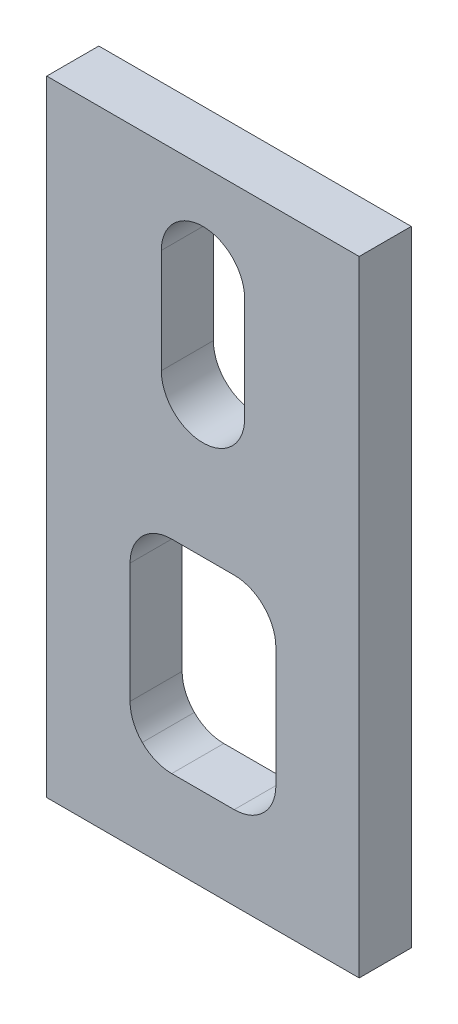
ISO-10303-21;
HEADER;
FILE_DESCRIPTION(('STEP AP214'),'2;1');
FILE_NAME('part.step','',(''),(''),'','','');
FILE_SCHEMA(('AUTOMOTIVE_DESIGN { 1 0 10303 214 1 1 1 1 }'));
ENDSEC;
DATA;
#1=APPLICATION_CONTEXT('core data for automotive mechanical design processes');
#2=APPLICATION_PROTOCOL_DEFINITION('international standard','automotive_design',2000,#1);
#3=PRODUCT_CONTEXT('',#1,'mechanical');
#4=PRODUCT('Part','Part','',(#3));
#5=PRODUCT_RELATED_PRODUCT_CATEGORY('part','',(#4));
#6=PRODUCT_DEFINITION_FORMATION('','',#4);
#7=PRODUCT_DEFINITION_CONTEXT('part definition',#1,'design');
#8=PRODUCT_DEFINITION('design','',#6,#7);
#9=PRODUCT_DEFINITION_SHAPE('','',#8);
#10=(LENGTH_UNIT() NAMED_UNIT(*) SI_UNIT(.MILLI.,.METRE.));
#11=(NAMED_UNIT(*) PLANE_ANGLE_UNIT() SI_UNIT($,.RADIAN.));
#12=(NAMED_UNIT(*) SI_UNIT($,.STERADIAN.) SOLID_ANGLE_UNIT());
#13=UNCERTAINTY_MEASURE_WITH_UNIT(LENGTH_MEASURE(1.E-05),#10,'distance_accuracy_value','');
#14=(GEOMETRIC_REPRESENTATION_CONTEXT(3) GLOBAL_UNCERTAINTY_ASSIGNED_CONTEXT((#13)) GLOBAL_UNIT_ASSIGNED_CONTEXT((#10,
#11,#12)) REPRESENTATION_CONTEXT('',''));
#15=CARTESIAN_POINT('',(0.,0.,0.));
#16=DIRECTION('',(0.,0.,1.));
#17=DIRECTION('',(1.,0.,0.));
#18=AXIS2_PLACEMENT_3D('',#15,#16,#17);
#19=CARTESIAN_POINT('',(0.,33.7259635528128,123.));
#20=DIRECTION('',(0.,0.,1.));
#21=DIRECTION('',(0.707106781186544,0.707106781186551,0.));
#22=AXIS2_PLACEMENT_3D('',#19,#20,#21);
#23=CYLINDRICAL_SURFACE('',#22,4.);
#24=DIRECTION('',(0.,0.,-1.));
#25=VECTOR('',#24,1.);
#26=CARTESIAN_POINT('',(2.82842712474616,36.554390677559,123.));
#27=LINE('',#26,#25);
#28=CARTESIAN_POINT('',(2.82842712474617,36.554390677559,125.5));
#29=VERTEX_POINT('',#28);
#30=CARTESIAN_POINT('',(2.82842712474616,36.554390677559,120.5));
#31=VERTEX_POINT('',#30);
#32=EDGE_CURVE('E268',#29,#31,#27,.T.);
#33=ORIENTED_EDGE('',*,*,#32,.F.);
#34=CARTESIAN_POINT('',(0.,33.7259635528128,125.5));
#35=DIRECTION('',(0.,0.,-1.));
#36=DIRECTION('',(-0.707106781186543,0.707106781186552,0.));
#37=AXIS2_PLACEMENT_3D('',#34,#35,#36);
#38=CIRCLE('',#37,4.);
#39=CARTESIAN_POINT('',(-4.,33.7259635528129,125.5));
#40=VERTEX_POINT('',#39);
#41=EDGE_CURVE('E63',#40,#29,#38,.T.);
#42=ORIENTED_EDGE('',*,*,#41,.F.);
#43=DIRECTION('',(0.,0.,1.));
#44=VECTOR('',#43,1.);
#45=CARTESIAN_POINT('',(-4.,33.7259635528129,123.));
#46=LINE('',#45,#44);
#47=CARTESIAN_POINT('',(-4.,33.7259635528129,120.5));
#48=VERTEX_POINT('',#47);
#49=EDGE_CURVE('E48',#48,#40,#46,.T.);
#50=ORIENTED_EDGE('',*,*,#49,.F.);
#51=CARTESIAN_POINT('',(0.,33.7259635528128,120.5));
#52=DIRECTION('',(0.,0.,1.));
#53=DIRECTION('',(0.707106781186544,0.707106781186551,0.));
#54=AXIS2_PLACEMENT_3D('',#51,#52,#53);
#55=CIRCLE('',#54,4.);
#56=EDGE_CURVE('E217',#31,#48,#55,.T.);
#57=ORIENTED_EDGE('',*,*,#56,.F.);
#58=EDGE_LOOP('',(#33,#42,#50,#57));
#59=FACE_BOUND('',#58,.T.);
#60=ADVANCED_FACE('F44',(#59),#23,.F.);
#61=CARTESIAN_POINT('',(0.,23.7259635528131,123.));
#62=DIRECTION('',(0.,0.,-1.));
#63=DIRECTION('',(0.707106781186543,-0.707106781186552,0.));
#64=AXIS2_PLACEMENT_3D('',#61,#62,#63);
#65=CYLINDRICAL_SURFACE('',#64,4.);
#66=DIRECTION('',(0.,0.,1.));
#67=VECTOR('',#66,1.);
#68=CARTESIAN_POINT('',(2.82842712474612,20.8975364280669,123.));
#69=LINE('',#68,#67);
#70=CARTESIAN_POINT('',(2.82842712474612,20.8975364280669,120.5));
#71=VERTEX_POINT('',#70);
#72=CARTESIAN_POINT('',(2.82842712474612,20.8975364280669,125.5));
#73=VERTEX_POINT('',#72);
#74=EDGE_CURVE('E218',#71,#73,#69,.T.);
#75=ORIENTED_EDGE('',*,*,#74,.F.);
#76=CARTESIAN_POINT('',(0.,23.7259635528131,120.5));
#77=DIRECTION('',(0.,0.,1.));
#78=DIRECTION('',(-0.707106781186544,-0.707106781186551,0.));
#79=AXIS2_PLACEMENT_3D('',#76,#77,#78);
#80=CIRCLE('',#79,4.);
#81=CARTESIAN_POINT('',(-4.00000000000006,23.7259635528131,120.5));
#82=VERTEX_POINT('',#81);
#83=EDGE_CURVE('E317',#82,#71,#80,.T.);
#84=ORIENTED_EDGE('',*,*,#83,.F.);
#85=DIRECTION('',(0.,0.,-1.));
#86=VECTOR('',#85,1.);
#87=CARTESIAN_POINT('',(-4.00000000000006,23.7259635528131,123.));
#88=LINE('',#87,#86);
#89=CARTESIAN_POINT('',(-4.,23.7259635528131,125.5));
#90=VERTEX_POINT('',#89);
#91=EDGE_CURVE('E235',#90,#82,#88,.T.);
#92=ORIENTED_EDGE('',*,*,#91,.F.);
#93=CARTESIAN_POINT('',(0.,23.7259635528131,125.5));
#94=DIRECTION('',(0.,0.,-1.));
#95=DIRECTION('',(0.707106781186543,-0.707106781186552,0.));
#96=AXIS2_PLACEMENT_3D('',#93,#94,#95);
#97=CIRCLE('',#96,4.);
#98=EDGE_CURVE('E287',#73,#90,#97,.T.);
#99=ORIENTED_EDGE('',*,*,#98,.F.);
#100=EDGE_LOOP('',(#75,#84,#92,#99));
#101=FACE_BOUND('',#100,.T.);
#102=ADVANCED_FACE('F420',(#101),#65,.F.);
#103=CARTESIAN_POINT('',(-3.,6.22596355281303,123.));
#104=DIRECTION('',(0.,0.,1.));
#105=DIRECTION('',(-0.707106781186542,0.707106781186553,0.));
#106=AXIS2_PLACEMENT_3D('',#103,#104,#105);
#107=CYLINDRICAL_SURFACE('',#106,4.);
#108=DIRECTION('',(0.,0.,-1.));
#109=VECTOR('',#108,1.);
#110=CARTESIAN_POINT('',(-5.82842712474615,9.05439067755924,123.));
#111=LINE('',#110,#109);
#112=CARTESIAN_POINT('',(-5.82842712474614,9.05439067755923,125.5));
#113=VERTEX_POINT('',#112);
#114=CARTESIAN_POINT('',(-5.82842712474615,9.05439067755924,120.5));
#115=VERTEX_POINT('',#114);
#116=EDGE_CURVE('E231',#113,#115,#111,.T.);
#117=ORIENTED_EDGE('',*,*,#116,.F.);
#118=CARTESIAN_POINT('',(-2.99999999999996,6.22596355281303,125.5));
#119=DIRECTION('',(0.,0.,-1.));
#120=DIRECTION('',(-0.707106781186542,0.707106781186553,0.));
#121=AXIS2_PLACEMENT_3D('',#118,#119,#120);
#122=CIRCLE('',#121,4.);
#123=CARTESIAN_POINT('',(-7.,6.22596355281291,125.5));
#124=VERTEX_POINT('',#123);
#125=EDGE_CURVE('E283',#124,#113,#122,.T.);
#126=ORIENTED_EDGE('',*,*,#125,.F.);
#127=DIRECTION('',(0.,0.,1.));
#128=VECTOR('',#127,1.);
#129=CARTESIAN_POINT('',(-7.,6.22596355281291,123.));
#130=LINE('',#129,#128);
#131=CARTESIAN_POINT('',(-7.,6.22596355281291,120.5));
#132=VERTEX_POINT('',#131);
#133=EDGE_CURVE('E290',#132,#124,#130,.T.);
#134=ORIENTED_EDGE('',*,*,#133,.F.);
#135=CARTESIAN_POINT('',(-3.,6.22596355281303,120.5));
#136=DIRECTION('',(0.,0.,1.));
#137=DIRECTION('',(-0.707106781186542,0.707106781186553,0.));
#138=AXIS2_PLACEMENT_3D('',#135,#136,#137);
#139=CIRCLE('',#138,4.);
#140=EDGE_CURVE('E227',#115,#132,#139,.T.);
#141=ORIENTED_EDGE('',*,*,#140,.F.);
#142=EDGE_LOOP('',(#117,#126,#134,#141));
#143=FACE_BOUND('',#142,.T.);
#144=ADVANCED_FACE('F382',(#143),#107,.F.);
#145=CARTESIAN_POINT('',(3.,6.22596355281291,123.));
#146=DIRECTION('',(0.,0.,-1.));
#147=DIRECTION('',(0.707106781186545,0.70710678118655,0.));
#148=AXIS2_PLACEMENT_3D('',#145,#146,#147);
#149=CYLINDRICAL_SURFACE('',#148,4.);
#150=DIRECTION('',(0.,0.,1.));
#151=VECTOR('',#150,1.);
#152=CARTESIAN_POINT('',(5.82842712474619,9.05439067755911,123.));
#153=LINE('',#152,#151);
#154=CARTESIAN_POINT('',(5.82842712474619,9.05439067755911,120.5));
#155=VERTEX_POINT('',#154);
#156=CARTESIAN_POINT('',(5.82842712474619,9.05439067755912,125.5));
#157=VERTEX_POINT('',#156);
#158=EDGE_CURVE('E256',#155,#157,#153,.T.);
#159=ORIENTED_EDGE('',*,*,#158,.F.);
#160=CARTESIAN_POINT('',(3.,6.22596355281291,120.5));
#161=DIRECTION('',(0.,0.,1.));
#162=DIRECTION('',(0.707106781186545,0.70710678118655,0.));
#163=AXIS2_PLACEMENT_3D('',#160,#161,#162);
#164=CIRCLE('',#163,4.);
#165=CARTESIAN_POINT('',(7.,6.22596355281303,120.5));
#166=VERTEX_POINT('',#165);
#167=EDGE_CURVE('E315',#166,#155,#164,.T.);
#168=ORIENTED_EDGE('',*,*,#167,.F.);
#169=DIRECTION('',(0.,0.,-1.));
#170=VECTOR('',#169,1.);
#171=CARTESIAN_POINT('',(7.,6.22596355281303,123.));
#172=LINE('',#171,#170);
#173=CARTESIAN_POINT('',(7.,6.22596355281303,125.5));
#174=VERTEX_POINT('',#173);
#175=EDGE_CURVE('E257',#174,#166,#172,.T.);
#176=ORIENTED_EDGE('',*,*,#175,.F.);
#177=CARTESIAN_POINT('',(3.,6.22596355281291,125.5));
#178=DIRECTION('',(0.,0.,-1.));
#179=DIRECTION('',(0.707106781186545,0.70710678118655,0.));
#180=AXIS2_PLACEMENT_3D('',#177,#178,#179);
#181=CIRCLE('',#180,4.);
#182=EDGE_CURVE('E225',#157,#174,#181,.T.);
#183=ORIENTED_EDGE('',*,*,#182,.F.);
#184=EDGE_LOOP('',(#159,#168,#176,#183));
#185=FACE_BOUND('',#184,.T.);
#186=ADVANCED_FACE('F453',(#185),#149,.F.);
#187=CARTESIAN_POINT('',(-3.,-5.27403644718709,123.));
#188=DIRECTION('',(0.,0.,-1.));
#189=DIRECTION('',(-0.707106781186544,-0.707106781186551,0.));
#190=AXIS2_PLACEMENT_3D('',#187,#188,#189);
#191=CYLINDRICAL_SURFACE('',#190,4.);
#192=DIRECTION('',(0.,0.,1.));
#193=VECTOR('',#192,1.);
#194=CARTESIAN_POINT('',(-5.82842712474615,-8.10246357193329,123.));
#195=LINE('',#194,#193);
#196=CARTESIAN_POINT('',(-5.82842712474615,-8.10246357193329,120.5));
#197=VERTEX_POINT('',#196);
#198=CARTESIAN_POINT('',(-5.82842712474614,-8.10246357193328,125.5));
#199=VERTEX_POINT('',#198);
#200=EDGE_CURVE('E252',#197,#199,#195,.T.);
#201=ORIENTED_EDGE('',*,*,#200,.F.);
#202=CARTESIAN_POINT('',(-3.,-5.27403644718709,120.5));
#203=DIRECTION('',(0.,0.,1.));
#204=DIRECTION('',(-0.707106781186544,-0.707106781186551,0.));
#205=AXIS2_PLACEMENT_3D('',#202,#203,#204);
#206=CIRCLE('',#205,4.);
#207=CARTESIAN_POINT('',(-7.,-5.27403644718709,120.5));
#208=VERTEX_POINT('',#207);
#209=EDGE_CURVE('E300',#208,#197,#206,.T.);
#210=ORIENTED_EDGE('',*,*,#209,.F.);
#211=DIRECTION('',(0.,0.,-1.));
#212=VECTOR('',#211,1.);
#213=CARTESIAN_POINT('',(-7.,-5.27403644718709,123.));
#214=LINE('',#213,#212);
#215=CARTESIAN_POINT('',(-7.,-5.27403644718709,125.5));
#216=VERTEX_POINT('',#215);
#217=EDGE_CURVE('E293',#216,#208,#214,.T.);
#218=ORIENTED_EDGE('',*,*,#217,.F.);
#219=CARTESIAN_POINT('',(-2.99999999999996,-5.27403644718709,125.5));
#220=DIRECTION('',(0.,0.,-1.));
#221=DIRECTION('',(-0.707106781186544,-0.707106781186551,0.));
#222=AXIS2_PLACEMENT_3D('',#219,#220,#221);
#223=CIRCLE('',#222,4.);
#224=EDGE_CURVE('E251',#199,#216,#223,.T.);
#225=ORIENTED_EDGE('',*,*,#224,.F.);
#226=EDGE_LOOP('',(#201,#210,#218,#225));
#227=FACE_BOUND('',#226,.T.);
#228=ADVANCED_FACE('F389',(#227),#191,.F.);
#229=CARTESIAN_POINT('',(3.,-5.27403644718709,123.));
#230=DIRECTION('',(0.,0.,1.));
#231=DIRECTION('',(0.707106781186542,-0.707106781186553,0.));
#232=AXIS2_PLACEMENT_3D('',#229,#230,#231);
#233=CYLINDRICAL_SURFACE('',#232,4.);
#234=DIRECTION('',(0.,0.,-1.));
#235=VECTOR('',#234,1.);
#236=CARTESIAN_POINT('',(5.82842712474618,-8.1024635719333,123.));
#237=LINE('',#236,#235);
#238=CARTESIAN_POINT('',(5.82842712474618,-8.10246357193331,125.5));
#239=VERTEX_POINT('',#238);
#240=CARTESIAN_POINT('',(5.82842712474618,-8.1024635719333,120.5));
#241=VERTEX_POINT('',#240);
#242=EDGE_CURVE('E11',#239,#241,#237,.T.);
#243=ORIENTED_EDGE('',*,*,#242,.F.);
#244=CARTESIAN_POINT('',(3.,-5.27403644718709,125.5));
#245=DIRECTION('',(0.,0.,-1.));
#246=DIRECTION('',(0.707106781186542,-0.707106781186553,0.));
#247=AXIS2_PLACEMENT_3D('',#244,#245,#246);
#248=CIRCLE('',#247,4.);
#249=CARTESIAN_POINT('',(7.,-5.2740364471872,125.5));
#250=VERTEX_POINT('',#249);
#251=EDGE_CURVE('E274',#250,#239,#248,.T.);
#252=ORIENTED_EDGE('',*,*,#251,.F.);
#253=DIRECTION('',(0.,0.,1.));
#254=VECTOR('',#253,1.);
#255=CARTESIAN_POINT('',(7.,-5.2740364471872,123.));
#256=LINE('',#255,#254);
#257=CARTESIAN_POINT('',(7.,-5.2740364471872,120.5));
#258=VERTEX_POINT('',#257);
#259=EDGE_CURVE('E259',#258,#250,#256,.T.);
#260=ORIENTED_EDGE('',*,*,#259,.F.);
#261=CARTESIAN_POINT('',(3.,-5.27403644718709,120.5));
#262=DIRECTION('',(0.,0.,1.));
#263=DIRECTION('',(0.707106781186542,-0.707106781186553,0.));
#264=AXIS2_PLACEMENT_3D('',#261,#262,#263);
#265=CIRCLE('',#264,4.);
#266=EDGE_CURVE('E207',#241,#258,#265,.T.);
#267=ORIENTED_EDGE('',*,*,#266,.F.);
#268=EDGE_LOOP('',(#243,#252,#260,#267));
#269=FACE_BOUND('',#268,.T.);
#270=ADVANCED_FACE('F452',(#269),#233,.F.);
#271=CARTESIAN_POINT('',(3.,-5.27403644718709,123.));
#272=DIRECTION('',(0.,0.,1.));
#273=DIRECTION('',(0.707106781186542,-0.707106781186553,0.));
#274=AXIS2_PLACEMENT_3D('',#271,#272,#273);
#275=CYLINDRICAL_SURFACE('',#274,4.);
#276=ORIENTED_EDGE('',*,*,#242,.T.);
#277=CARTESIAN_POINT('',(3.,-5.27403644718709,120.5));
#278=DIRECTION('',(0.,0.,1.));
#279=DIRECTION('',(0.707106781186542,-0.707106781186553,0.));
#280=AXIS2_PLACEMENT_3D('',#277,#278,#279);
#281=CIRCLE('',#280,4.);
#282=CARTESIAN_POINT('',(3.,-9.27403644718709,120.5));
#283=VERTEX_POINT('',#282);
#284=EDGE_CURVE('E296',#283,#241,#281,.T.);
#285=ORIENTED_EDGE('',*,*,#284,.F.);
#286=DIRECTION('',(0.,0.,-1.));
#287=VECTOR('',#286,1.);
#288=CARTESIAN_POINT('',(3.,-9.27403644718709,123.));
#289=LINE('',#288,#287);
#290=CARTESIAN_POINT('',(3.,-9.27403644718709,125.5));
#291=VERTEX_POINT('',#290);
#292=EDGE_CURVE('E54',#291,#283,#289,.T.);
#293=ORIENTED_EDGE('',*,*,#292,.F.);
#294=CARTESIAN_POINT('',(3.,-5.27403644718709,125.5));
#295=DIRECTION('',(0.,0.,-1.));
#296=DIRECTION('',(0.707106781186542,-0.707106781186553,0.));
#297=AXIS2_PLACEMENT_3D('',#294,#295,#296);
#298=CIRCLE('',#297,4.);
#299=EDGE_CURVE('E295',#239,#291,#298,.T.);
#300=ORIENTED_EDGE('',*,*,#299,.F.);
#301=EDGE_LOOP('',(#276,#285,#293,#300));
#302=FACE_BOUND('',#301,.T.);
#303=ADVANCED_FACE('F46',(#302),#275,.F.);
#304=CARTESIAN_POINT('',(0.,-9.2740364471872,123.));
#305=DIRECTION('',(0.,1.,0.));
#306=DIRECTION('',(1.,0.,0.));
#307=AXIS2_PLACEMENT_3D('',#304,#305,#306);
#308=PLANE('',#307);
#309=ORIENTED_EDGE('',*,*,#292,.T.);
#310=DIRECTION('',(1.,0.,0.));
#311=VECTOR('',#310,1.);
#312=CARTESIAN_POINT('',(0.,-9.2740364471872,120.5));
#313=LINE('',#312,#311);
#314=CARTESIAN_POINT('',(-3.,-9.2740364471872,120.5));
#315=VERTEX_POINT('',#314);
#316=EDGE_CURVE('E299',#315,#283,#313,.T.);
#317=ORIENTED_EDGE('',*,*,#316,.F.);
#318=DIRECTION('',(0.,0.,1.));
#319=VECTOR('',#318,1.);
#320=CARTESIAN_POINT('',(-3.,-9.2740364471872,123.));
#321=LINE('',#320,#319);
#322=CARTESIAN_POINT('',(-2.99999999999996,-9.2740364471872,125.5));
#323=VERTEX_POINT('',#322);
#324=EDGE_CURVE('E255',#315,#323,#321,.T.);
#325=ORIENTED_EDGE('',*,*,#324,.T.);
#326=DIRECTION('',(-1.,0.,0.));
#327=VECTOR('',#326,1.);
#328=CARTESIAN_POINT('',(0.,-9.2740364471872,125.5));
#329=LINE('',#328,#327);
#330=EDGE_CURVE('E250',#291,#323,#329,.T.);
#331=ORIENTED_EDGE('',*,*,#330,.F.);
#332=EDGE_LOOP('',(#309,#317,#325,#331));
#333=FACE_BOUND('',#332,.T.);
#334=ADVANCED_FACE('F461',(#333),#308,.T.);
#335=CARTESIAN_POINT('',(-3.,-5.27403644718709,123.));
#336=DIRECTION('',(0.,0.,-1.));
#337=DIRECTION('',(-0.707106781186544,-0.707106781186551,0.));
#338=AXIS2_PLACEMENT_3D('',#335,#336,#337);
#339=CYLINDRICAL_SURFACE('',#338,4.);
#340=ORIENTED_EDGE('',*,*,#200,.T.);
#341=CARTESIAN_POINT('',(-2.99999999999996,-5.27403644718709,125.5));
#342=DIRECTION('',(0.,0.,-1.));
#343=DIRECTION('',(-0.707106781186544,-0.707106781186551,0.));
#344=AXIS2_PLACEMENT_3D('',#341,#342,#343);
#345=CIRCLE('',#344,4.);
#346=EDGE_CURVE('E247',#323,#199,#345,.T.);
#347=ORIENTED_EDGE('',*,*,#346,.F.);
#348=ORIENTED_EDGE('',*,*,#324,.F.);
#349=CARTESIAN_POINT('',(-3.,-5.27403644718709,120.5));
#350=DIRECTION('',(0.,0.,1.));
#351=DIRECTION('',(-0.707106781186544,-0.707106781186551,0.));
#352=AXIS2_PLACEMENT_3D('',#349,#350,#351);
#353=CIRCLE('',#352,4.);
#354=EDGE_CURVE('E303',#197,#315,#353,.T.);
#355=ORIENTED_EDGE('',*,*,#354,.F.);
#356=EDGE_LOOP('',(#340,#347,#348,#355));
#357=FACE_BOUND('',#356,.T.);
#358=ADVANCED_FACE('F395',(#357),#339,.F.);
#359=CARTESIAN_POINT('',(3.,6.22596355281291,123.));
#360=DIRECTION('',(0.,0.,-1.));
#361=DIRECTION('',(0.707106781186545,0.70710678118655,0.));
#362=AXIS2_PLACEMENT_3D('',#359,#360,#361);
#363=CYLINDRICAL_SURFACE('',#362,4.);
#364=ORIENTED_EDGE('',*,*,#158,.T.);
#365=CARTESIAN_POINT('',(3.,6.22596355281291,125.5));
#366=DIRECTION('',(0.,0.,-1.));
#367=DIRECTION('',(0.707106781186545,0.70710678118655,0.));
#368=AXIS2_PLACEMENT_3D('',#365,#366,#367);
#369=CIRCLE('',#368,4.);
#370=CARTESIAN_POINT('',(3.,10.225963552813,125.5));
#371=VERTEX_POINT('',#370);
#372=EDGE_CURVE('E222',#371,#157,#369,.T.);
#373=ORIENTED_EDGE('',*,*,#372,.F.);
#374=DIRECTION('',(0.,0.,1.));
#375=VECTOR('',#374,1.);
#376=CARTESIAN_POINT('',(3.,10.225963552813,123.));
#377=LINE('',#376,#375);
#378=CARTESIAN_POINT('',(3.,10.225963552813,120.5));
#379=VERTEX_POINT('',#378);
#380=EDGE_CURVE('E239',#379,#371,#377,.T.);
#381=ORIENTED_EDGE('',*,*,#380,.F.);
#382=CARTESIAN_POINT('',(3.,6.22596355281291,120.5));
#383=DIRECTION('',(0.,0.,1.));
#384=DIRECTION('',(0.707106781186545,0.70710678118655,0.));
#385=AXIS2_PLACEMENT_3D('',#382,#383,#384);
#386=CIRCLE('',#385,4.);
#387=EDGE_CURVE('E263',#155,#379,#386,.T.);
#388=ORIENTED_EDGE('',*,*,#387,.F.);
#389=EDGE_LOOP('',(#364,#373,#381,#388));
#390=FACE_BOUND('',#389,.T.);
#391=ADVANCED_FACE('F369',(#390),#363,.F.);
#392=CARTESIAN_POINT('',(0.,10.225963552813,123.));
#393=DIRECTION('',(0.,-1.,0.));
#394=DIRECTION('',(0.,0.,-1.));
#395=AXIS2_PLACEMENT_3D('',#392,#393,#394);
#396=PLANE('',#395);
#397=ORIENTED_EDGE('',*,*,#380,.T.);
#398=DIRECTION('',(-1.,0.,0.));
#399=VECTOR('',#398,1.);
#400=CARTESIAN_POINT('',(0.,10.225963552813,125.5));
#401=LINE('',#400,#399);
#402=CARTESIAN_POINT('',(-2.99999999999996,10.225963552813,125.5));
#403=VERTEX_POINT('',#402);
#404=EDGE_CURVE('E236',#371,#403,#401,.T.);
#405=ORIENTED_EDGE('',*,*,#404,.T.);
#406=DIRECTION('',(0.,0.,-1.));
#407=VECTOR('',#406,1.);
#408=CARTESIAN_POINT('',(-3.,10.225963552813,123.));
#409=LINE('',#408,#407);
#410=CARTESIAN_POINT('',(-3.,10.225963552813,120.5));
#411=VERTEX_POINT('',#410);
#412=EDGE_CURVE('E240',#403,#411,#409,.T.);
#413=ORIENTED_EDGE('',*,*,#412,.T.);
#414=DIRECTION('',(1.,0.,0.));
#415=VECTOR('',#414,1.);
#416=CARTESIAN_POINT('',(0.,10.225963552813,120.5));
#417=LINE('',#416,#415);
#418=EDGE_CURVE('E234',#411,#379,#417,.T.);
#419=ORIENTED_EDGE('',*,*,#418,.T.);
#420=EDGE_LOOP('',(#397,#405,#413,#419));
#421=FACE_BOUND('',#420,.T.);
#422=ADVANCED_FACE('F372',(#421),#396,.T.);
#423=CARTESIAN_POINT('',(-3.,6.22596355281303,123.));
#424=DIRECTION('',(0.,0.,1.));
#425=DIRECTION('',(-0.707106781186542,0.707106781186553,0.));
#426=AXIS2_PLACEMENT_3D('',#423,#424,#425);
#427=CYLINDRICAL_SURFACE('',#426,4.);
#428=ORIENTED_EDGE('',*,*,#116,.T.);
#429=CARTESIAN_POINT('',(-3.,6.22596355281303,120.5));
#430=DIRECTION('',(0.,0.,1.));
#431=DIRECTION('',(-0.707106781186542,0.707106781186553,0.));
#432=AXIS2_PLACEMENT_3D('',#429,#430,#431);
#433=CIRCLE('',#432,4.);
#434=EDGE_CURVE('E229',#411,#115,#433,.T.);
#435=ORIENTED_EDGE('',*,*,#434,.F.);
#436=ORIENTED_EDGE('',*,*,#412,.F.);
#437=CARTESIAN_POINT('',(-2.99999999999996,6.22596355281303,125.5));
#438=DIRECTION('',(0.,0.,-1.));
#439=DIRECTION('',(-0.707106781186542,0.707106781186553,0.));
#440=AXIS2_PLACEMENT_3D('',#437,#438,#439);
#441=CIRCLE('',#440,4.);
#442=EDGE_CURVE('E224',#113,#403,#441,.T.);
#443=ORIENTED_EDGE('',*,*,#442,.F.);
#444=EDGE_LOOP('',(#428,#435,#436,#443));
#445=FACE_BOUND('',#444,.T.);
#446=ADVANCED_FACE('F377',(#445),#427,.F.);
#447=CARTESIAN_POINT('',(-4.,28.7259635528129,123.));
#448=DIRECTION('',(1.,0.,0.));
#449=DIRECTION('',(0.,0.,1.));
#450=AXIS2_PLACEMENT_3D('',#447,#448,#449);
#451=PLANE('',#450);
#452=ORIENTED_EDGE('',*,*,#91,.T.);
#453=DIRECTION('',(0.,1.,0.));
#454=VECTOR('',#453,1.);
#455=CARTESIAN_POINT('',(-4.,28.7259635528129,120.5));
#456=LINE('',#455,#454);
#457=EDGE_CURVE('E243',#82,#48,#456,.T.);
#458=ORIENTED_EDGE('',*,*,#457,.T.);
#459=ORIENTED_EDGE('',*,*,#49,.T.);
#460=DIRECTION('',(0.,1.,0.));
#461=VECTOR('',#460,1.);
#462=CARTESIAN_POINT('',(-4.,28.7259635528129,125.5));
#463=LINE('',#462,#461);
#464=EDGE_CURVE('E273',#90,#40,#463,.T.);
#465=ORIENTED_EDGE('',*,*,#464,.F.);
#466=EDGE_LOOP('',(#452,#458,#459,#465));
#467=FACE_BOUND('',#466,.T.);
#468=ADVANCED_FACE('F416',(#467),#451,.T.);
#469=CARTESIAN_POINT('',(0.,23.7259635528131,123.));
#470=DIRECTION('',(0.,0.,-1.));
#471=DIRECTION('',(0.707106781186543,-0.707106781186552,0.));
#472=AXIS2_PLACEMENT_3D('',#469,#470,#471);
#473=CYLINDRICAL_SURFACE('',#472,4.);
#474=ORIENTED_EDGE('',*,*,#74,.T.);
#475=CARTESIAN_POINT('',(0.,23.7259635528131,125.5));
#476=DIRECTION('',(0.,0.,-1.));
#477=DIRECTION('',(0.707106781186543,-0.707106781186552,0.));
#478=AXIS2_PLACEMENT_3D('',#475,#476,#477);
#479=CIRCLE('',#478,4.);
#480=CARTESIAN_POINT('',(3.99999999999995,23.7259635528131,125.5));
#481=VERTEX_POINT('',#480);
#482=EDGE_CURVE('E289',#481,#73,#479,.T.);
#483=ORIENTED_EDGE('',*,*,#482,.F.);
#484=DIRECTION('',(0.,0.,1.));
#485=VECTOR('',#484,1.);
#486=CARTESIAN_POINT('',(3.99999999999994,23.7259635528131,123.));
#487=LINE('',#486,#485);
#488=CARTESIAN_POINT('',(3.99999999999994,23.7259635528131,120.5));
#489=VERTEX_POINT('',#488);
#490=EDGE_CURVE('E221',#489,#481,#487,.T.);
#491=ORIENTED_EDGE('',*,*,#490,.F.);
#492=CARTESIAN_POINT('',(0.,23.7259635528131,120.5));
#493=DIRECTION('',(0.,0.,1.));
#494=DIRECTION('',(-0.707106781186544,-0.707106781186551,0.));
#495=AXIS2_PLACEMENT_3D('',#492,#493,#494);
#496=CIRCLE('',#495,4.);
#497=EDGE_CURVE('E322',#71,#489,#496,.T.);
#498=ORIENTED_EDGE('',*,*,#497,.F.);
#499=EDGE_LOOP('',(#474,#483,#491,#498));
#500=FACE_BOUND('',#499,.T.);
#501=ADVANCED_FACE('F422',(#500),#473,.F.);
#502=CARTESIAN_POINT('',(4.,28.725963552813,123.));
#503=DIRECTION('',(-1.,0.,0.));
#504=DIRECTION('',(0.,0.,1.));
#505=AXIS2_PLACEMENT_3D('',#502,#503,#504);
#506=PLANE('',#505);
#507=ORIENTED_EDGE('',*,*,#490,.T.);
#508=DIRECTION('',(0.,1.,0.));
#509=VECTOR('',#508,1.);
#510=CARTESIAN_POINT('',(4.,28.725963552813,125.5));
#511=LINE('',#510,#509);
#512=CARTESIAN_POINT('',(4.,33.7259635528129,125.5));
#513=VERTEX_POINT('',#512);
#514=EDGE_CURVE('E267',#481,#513,#511,.T.);
#515=ORIENTED_EDGE('',*,*,#514,.T.);
#516=DIRECTION('',(0.,0.,-1.));
#517=VECTOR('',#516,1.);
#518=CARTESIAN_POINT('',(4.,33.7259635528129,123.));
#519=LINE('',#518,#517);
#520=CARTESIAN_POINT('',(4.,33.7259635528129,120.5));
#521=VERTEX_POINT('',#520);
#522=EDGE_CURVE('E264',#513,#521,#519,.T.);
#523=ORIENTED_EDGE('',*,*,#522,.T.);
#524=DIRECTION('',(0.,1.,0.));
#525=VECTOR('',#524,1.);
#526=CARTESIAN_POINT('',(4.,28.725963552813,120.5));
#527=LINE('',#526,#525);
#528=EDGE_CURVE('E216',#489,#521,#527,.T.);
#529=ORIENTED_EDGE('',*,*,#528,.F.);
#530=EDGE_LOOP('',(#507,#515,#523,#529));
#531=FACE_BOUND('',#530,.T.);
#532=ADVANCED_FACE('F406',(#531),#506,.T.);
#533=CARTESIAN_POINT('',(0.,33.7259635528128,123.));
#534=DIRECTION('',(0.,0.,1.));
#535=DIRECTION('',(0.707106781186544,0.707106781186551,0.));
#536=AXIS2_PLACEMENT_3D('',#533,#534,#535);
#537=CYLINDRICAL_SURFACE('',#536,4.);
#538=ORIENTED_EDGE('',*,*,#32,.T.);
#539=CARTESIAN_POINT('',(0.,33.7259635528128,120.5));
#540=DIRECTION('',(0.,0.,1.));
#541=DIRECTION('',(0.707106781186544,0.707106781186551,0.));
#542=AXIS2_PLACEMENT_3D('',#539,#540,#541);
#543=CIRCLE('',#542,4.);
#544=EDGE_CURVE('E213',#521,#31,#543,.T.);
#545=ORIENTED_EDGE('',*,*,#544,.F.);
#546=ORIENTED_EDGE('',*,*,#522,.F.);
#547=CARTESIAN_POINT('',(0.,33.7259635528128,125.5));
#548=DIRECTION('',(0.,0.,-1.));
#549=DIRECTION('',(-0.707106781186543,0.707106781186552,0.));
#550=AXIS2_PLACEMENT_3D('',#547,#548,#549);
#551=CIRCLE('',#550,4.);
#552=EDGE_CURVE('E212',#29,#513,#551,.T.);
#553=ORIENTED_EDGE('',*,*,#552,.F.);
#554=EDGE_LOOP('',(#538,#545,#546,#553));
#555=FACE_BOUND('',#554,.T.);
#556=ADVANCED_FACE('F410',(#555),#537,.F.);
#557=CARTESIAN_POINT('',(-7.,25.7259635528128,123.));
#558=DIRECTION('',(1.,0.,0.));
#559=DIRECTION('',(0.,1.,0.));
#560=AXIS2_PLACEMENT_3D('',#557,#558,#559);
#561=PLANE('',#560);
#562=ORIENTED_EDGE('',*,*,#217,.T.);
#563=DIRECTION('',(0.,-1.,0.));
#564=VECTOR('',#563,1.);
#565=CARTESIAN_POINT('',(-7.,26.2259635528128,120.5));
#566=LINE('',#565,#564);
#567=EDGE_CURVE('E302',#132,#208,#566,.T.);
#568=ORIENTED_EDGE('',*,*,#567,.F.);
#569=ORIENTED_EDGE('',*,*,#133,.T.);
#570=DIRECTION('',(0.,1.,0.));
#571=VECTOR('',#570,1.);
#572=CARTESIAN_POINT('',(-7.,26.2259635528128,125.5));
#573=LINE('',#572,#571);
#574=EDGE_CURVE('E286',#216,#124,#573,.T.);
#575=ORIENTED_EDGE('',*,*,#574,.F.);
#576=EDGE_LOOP('',(#562,#568,#569,#575));
#577=FACE_BOUND('',#576,.T.);
#578=ADVANCED_FACE('F385',(#577),#561,.T.);
#579=CARTESIAN_POINT('',(7.,25.7259635528128,123.));
#580=DIRECTION('',(1.,0.,0.));
#581=DIRECTION('',(0.,1.,0.));
#582=AXIS2_PLACEMENT_3D('',#579,#580,#581);
#583=PLANE('',#582);
#584=ORIENTED_EDGE('',*,*,#259,.T.);
#585=DIRECTION('',(0.,-1.,0.));
#586=VECTOR('',#585,1.);
#587=CARTESIAN_POINT('',(7.,26.2259635528128,125.5));
#588=LINE('',#587,#586);
#589=EDGE_CURVE('E270',#174,#250,#588,.T.);
#590=ORIENTED_EDGE('',*,*,#589,.F.);
#591=ORIENTED_EDGE('',*,*,#175,.T.);
#592=DIRECTION('',(0.,1.,0.));
#593=VECTOR('',#592,1.);
#594=CARTESIAN_POINT('',(7.,26.2259635528128,120.5));
#595=LINE('',#594,#593);
#596=EDGE_CURVE('E313',#258,#166,#595,.T.);
#597=ORIENTED_EDGE('',*,*,#596,.F.);
#598=EDGE_LOOP('',(#584,#590,#591,#597));
#599=FACE_BOUND('',#598,.T.);
#600=ADVANCED_FACE('F449',(#599),#583,.F.);
#601=CARTESIAN_POINT('',(0.,42.725963552813,123.));
#602=DIRECTION('',(0.,-1.,0.));
#603=DIRECTION('',(0.,0.,-1.));
#604=AXIS2_PLACEMENT_3D('',#601,#602,#603);
#605=PLANE('',#604);
#606=DIRECTION('',(1.,0.,0.));
#607=VECTOR('',#606,1.);
#608=CARTESIAN_POINT('',(0.,42.725963552813,120.5));
#609=LINE('',#608,#607);
#610=CARTESIAN_POINT('',(-15.,42.7259635528131,120.5));
#611=VERTEX_POINT('',#610);
#612=CARTESIAN_POINT('',(15.,42.725963552813,120.5));
#613=VERTEX_POINT('',#612);
#614=EDGE_CURVE('E210',#611,#613,#609,.T.);
#615=ORIENTED_EDGE('',*,*,#614,.F.);
#616=DIRECTION('',(0.,0.,1.));
#617=VECTOR('',#616,1.);
#618=CARTESIAN_POINT('',(-15.,42.7259635528131,123.));
#619=LINE('',#618,#617);
#620=CARTESIAN_POINT('',(-15.,42.7259635528131,125.5));
#621=VERTEX_POINT('',#620);
#622=EDGE_CURVE('E195',#611,#621,#619,.T.);
#623=ORIENTED_EDGE('',*,*,#622,.T.);
#624=DIRECTION('',(1.,0.,0.));
#625=VECTOR('',#624,1.);
#626=CARTESIAN_POINT('',(0.,42.725963552813,125.5));
#627=LINE('',#626,#625);
#628=CARTESIAN_POINT('',(15.,42.725963552813,125.5));
#629=VERTEX_POINT('',#628);
#630=EDGE_CURVE('E190',#621,#629,#627,.T.);
#631=ORIENTED_EDGE('',*,*,#630,.T.);
#632=DIRECTION('',(0.,0.,-1.));
#633=VECTOR('',#632,1.);
#634=CARTESIAN_POINT('',(15.,42.725963552813,123.));
#635=LINE('',#634,#633);
#636=EDGE_CURVE('E180',#629,#613,#635,.T.);
#637=ORIENTED_EDGE('',*,*,#636,.T.);
#638=EDGE_LOOP('',(#615,#623,#631,#637));
#639=FACE_BOUND('',#638,.T.);
#640=ADVANCED_FACE('F193',(#639),#605,.F.);
#641=CARTESIAN_POINT('',(15.,26.7259635528128,123.));
#642=DIRECTION('',(1.,0.,0.));
#643=DIRECTION('',(0.,1.,0.));
#644=AXIS2_PLACEMENT_3D('',#641,#642,#643);
#645=PLANE('',#644);
#646=ORIENTED_EDGE('',*,*,#636,.F.);
#647=DIRECTION('',(0.,-1.,0.));
#648=VECTOR('',#647,1.);
#649=CARTESIAN_POINT('',(15.,26.7259635528128,125.5));
#650=LINE('',#649,#648);
#651=CARTESIAN_POINT('',(15.,-17.2740364471872,125.5));
#652=VERTEX_POINT('',#651);
#653=EDGE_CURVE('E185',#629,#652,#650,.T.);
#654=ORIENTED_EDGE('',*,*,#653,.T.);
#655=DIRECTION('',(0.,0.,-1.));
#656=VECTOR('',#655,1.);
#657=CARTESIAN_POINT('',(15.,-17.2740364471872,123.));
#658=LINE('',#657,#656);
#659=CARTESIAN_POINT('',(15.,-17.2740364471872,120.5));
#660=VERTEX_POINT('',#659);
#661=EDGE_CURVE('E202',#652,#660,#658,.T.);
#662=ORIENTED_EDGE('',*,*,#661,.T.);
#663=DIRECTION('',(0.,1.,0.));
#664=VECTOR('',#663,1.);
#665=CARTESIAN_POINT('',(15.,26.7259635528128,120.5));
#666=LINE('',#665,#664);
#667=EDGE_CURVE('E188',#660,#613,#666,.T.);
#668=ORIENTED_EDGE('',*,*,#667,.T.);
#669=EDGE_LOOP('',(#646,#654,#662,#668));
#670=FACE_BOUND('',#669,.T.);
#671=ADVANCED_FACE('F182',(#670),#645,.T.);
#672=CARTESIAN_POINT('',(0.,26.7259635528129,120.5));
#673=DIRECTION('',(0.,0.,1.));
#674=DIRECTION('',(1.,0.,0.));
#675=AXIS2_PLACEMENT_3D('',#672,#673,#674);
#676=PLANE('',#675);
#677=ORIENTED_EDGE('',*,*,#614,.T.);
#678=ORIENTED_EDGE('',*,*,#667,.F.);
#679=DIRECTION('',(-1.,0.,0.));
#680=VECTOR('',#679,1.);
#681=CARTESIAN_POINT('',(0.,-17.2740364471872,120.5));
#682=LINE('',#681,#680);
#683=CARTESIAN_POINT('',(-15.,-17.2740364471871,120.5));
#684=VERTEX_POINT('',#683);
#685=EDGE_CURVE('E306',#660,#684,#682,.T.);
#686=ORIENTED_EDGE('',*,*,#685,.T.);
#687=DIRECTION('',(0.,-1.,0.));
#688=VECTOR('',#687,1.);
#689=CARTESIAN_POINT('',(-15.,26.7259635528129,120.5));
#690=LINE('',#689,#688);
#691=EDGE_CURVE('E230',#611,#684,#690,.T.);
#692=ORIENTED_EDGE('',*,*,#691,.F.);
#693=EDGE_LOOP('',(#677,#678,#686,#692));
#694=FACE_BOUND('',#693,.T.);
#695=ORIENTED_EDGE('',*,*,#83,.T.);
#696=ORIENTED_EDGE('',*,*,#497,.T.);
#697=ORIENTED_EDGE('',*,*,#528,.T.);
#698=ORIENTED_EDGE('',*,*,#544,.T.);
#699=ORIENTED_EDGE('',*,*,#56,.T.);
#700=ORIENTED_EDGE('',*,*,#457,.F.);
#701=EDGE_LOOP('',(#695,#696,#697,#698,#699,#700));
#702=FACE_BOUND('',#701,.T.);
#703=ORIENTED_EDGE('',*,*,#567,.T.);
#704=ORIENTED_EDGE('',*,*,#209,.T.);
#705=ORIENTED_EDGE('',*,*,#354,.T.);
#706=ORIENTED_EDGE('',*,*,#316,.T.);
#707=ORIENTED_EDGE('',*,*,#284,.T.);
#708=ORIENTED_EDGE('',*,*,#266,.T.);
#709=ORIENTED_EDGE('',*,*,#596,.T.);
#710=ORIENTED_EDGE('',*,*,#167,.T.);
#711=ORIENTED_EDGE('',*,*,#387,.T.);
#712=ORIENTED_EDGE('',*,*,#418,.F.);
#713=ORIENTED_EDGE('',*,*,#434,.T.);
#714=ORIENTED_EDGE('',*,*,#140,.T.);
#715=EDGE_LOOP('',(#703,#704,#705,#706,#707,#708,#709,#710,#711,#712,#713,#714));
#716=FACE_BOUND('',#715,.T.);
#717=ADVANCED_FACE('F363',(#694,#702,#716),#676,.F.);
#718=CARTESIAN_POINT('',(-15.,26.7259635528129,123.));
#719=DIRECTION('',(1.,0.,0.));
#720=DIRECTION('',(0.,1.,0.));
#721=AXIS2_PLACEMENT_3D('',#718,#719,#720);
#722=PLANE('',#721);
#723=ORIENTED_EDGE('',*,*,#622,.F.);
#724=ORIENTED_EDGE('',*,*,#691,.T.);
#725=DIRECTION('',(0.,0.,1.));
#726=VECTOR('',#725,1.);
#727=CARTESIAN_POINT('',(-15.,-17.2740364471871,123.));
#728=LINE('',#727,#726);
#729=CARTESIAN_POINT('',(-15.,-17.2740364471871,125.5));
#730=VERTEX_POINT('',#729);
#731=EDGE_CURVE('E246',#684,#730,#728,.T.);
#732=ORIENTED_EDGE('',*,*,#731,.T.);
#733=DIRECTION('',(0.,1.,0.));
#734=VECTOR('',#733,1.);
#735=CARTESIAN_POINT('',(-15.,26.7259635528129,125.5));
#736=LINE('',#735,#734);
#737=EDGE_CURVE('E244',#730,#621,#736,.T.);
#738=ORIENTED_EDGE('',*,*,#737,.T.);
#739=EDGE_LOOP('',(#723,#724,#732,#738));
#740=FACE_BOUND('',#739,.T.);
#741=ADVANCED_FACE('F429',(#740),#722,.F.);
#742=CARTESIAN_POINT('',(0.,-17.2740364471872,123.));
#743=DIRECTION('',(0.,1.,0.));
#744=DIRECTION('',(1.,0.,0.));
#745=AXIS2_PLACEMENT_3D('',#742,#743,#744);
#746=PLANE('',#745);
#747=DIRECTION('',(-1.,0.,0.));
#748=VECTOR('',#747,1.);
#749=CARTESIAN_POINT('',(0.,-17.2740364471872,125.5));
#750=LINE('',#749,#748);
#751=EDGE_CURVE('E201',#652,#730,#750,.T.);
#752=ORIENTED_EDGE('',*,*,#751,.T.);
#753=ORIENTED_EDGE('',*,*,#731,.F.);
#754=ORIENTED_EDGE('',*,*,#685,.F.);
#755=ORIENTED_EDGE('',*,*,#661,.F.);
#756=EDGE_LOOP('',(#752,#753,#754,#755));
#757=FACE_BOUND('',#756,.T.);
#758=ADVANCED_FACE('F424',(#757),#746,.F.);
#759=CARTESIAN_POINT('',(0.,26.7259635528129,125.5));
#760=DIRECTION('',(0.,0.,-1.));
#761=DIRECTION('',(-1.,0.,0.));
#762=AXIS2_PLACEMENT_3D('',#759,#760,#761);
#763=PLANE('',#762);
#764=ORIENTED_EDGE('',*,*,#630,.F.);
#765=ORIENTED_EDGE('',*,*,#737,.F.);
#766=ORIENTED_EDGE('',*,*,#751,.F.);
#767=ORIENTED_EDGE('',*,*,#653,.F.);
#768=EDGE_LOOP('',(#764,#765,#766,#767));
#769=FACE_BOUND('',#768,.T.);
#770=ORIENTED_EDGE('',*,*,#41,.T.);
#771=ORIENTED_EDGE('',*,*,#552,.T.);
#772=ORIENTED_EDGE('',*,*,#514,.F.);
#773=ORIENTED_EDGE('',*,*,#482,.T.);
#774=ORIENTED_EDGE('',*,*,#98,.T.);
#775=ORIENTED_EDGE('',*,*,#464,.T.);
#776=EDGE_LOOP('',(#770,#771,#772,#773,#774,#775));
#777=FACE_BOUND('',#776,.T.);
#778=ORIENTED_EDGE('',*,*,#589,.T.);
#779=ORIENTED_EDGE('',*,*,#251,.T.);
#780=ORIENTED_EDGE('',*,*,#299,.T.);
#781=ORIENTED_EDGE('',*,*,#330,.T.);
#782=ORIENTED_EDGE('',*,*,#346,.T.);
#783=ORIENTED_EDGE('',*,*,#224,.T.);
#784=ORIENTED_EDGE('',*,*,#574,.T.);
#785=ORIENTED_EDGE('',*,*,#125,.T.);
#786=ORIENTED_EDGE('',*,*,#442,.T.);
#787=ORIENTED_EDGE('',*,*,#404,.F.);
#788=ORIENTED_EDGE('',*,*,#372,.T.);
#789=ORIENTED_EDGE('',*,*,#182,.T.);
#790=EDGE_LOOP('',(#778,#779,#780,#781,#782,#783,#784,#785,#786,#787,#788,#789));
#791=FACE_BOUND('',#790,.T.);
#792=ADVANCED_FACE('F199',(#769,#777,#791),#763,.F.);
#793=CLOSED_SHELL('',(#60,#102,#144,#186,#228,#270,#303,#334,#358,#391,#422,#446,#468,#501,#532,
#556,#578,#600,#640,#671,#717,#741,#758,#792));
#794=MANIFOLD_SOLID_BREP('B2',#793);
#795=ADVANCED_BREP_SHAPE_REPRESENTATION('',(#18,#794),#14);
#796=SHAPE_DEFINITION_REPRESENTATION(#9,#795);
ENDSEC;
END-ISO-10303-21;
